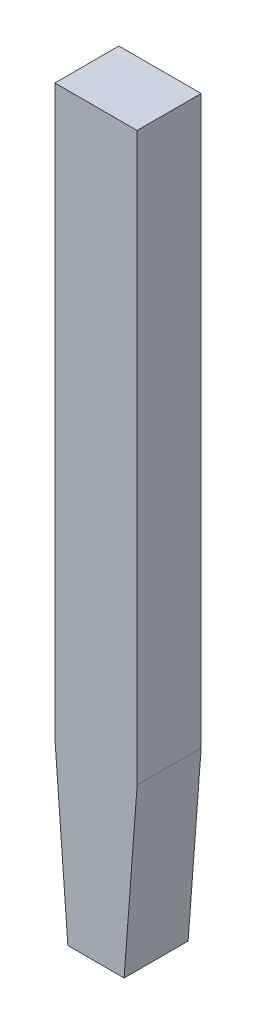
ISO-10303-21;
HEADER;
FILE_DESCRIPTION(('STEP AP214'),'2;1');
FILE_NAME('part.step','',(''),(''),'','','');
FILE_SCHEMA(('AUTOMOTIVE_DESIGN { 1 0 10303 214 1 1 1 1 }'));
ENDSEC;
DATA;
#1=APPLICATION_CONTEXT('core data for automotive mechanical design processes');
#2=APPLICATION_PROTOCOL_DEFINITION('international standard','automotive_design',2000,#1);
#3=PRODUCT_CONTEXT('',#1,'mechanical');
#4=PRODUCT('Part','Part','',(#3));
#5=PRODUCT_RELATED_PRODUCT_CATEGORY('part','',(#4));
#6=PRODUCT_DEFINITION_FORMATION('','',#4);
#7=PRODUCT_DEFINITION_CONTEXT('part definition',#1,'design');
#8=PRODUCT_DEFINITION('design','',#6,#7);
#9=PRODUCT_DEFINITION_SHAPE('','',#8);
#10=(LENGTH_UNIT() NAMED_UNIT(*) SI_UNIT(.MILLI.,.METRE.));
#11=(NAMED_UNIT(*) PLANE_ANGLE_UNIT() SI_UNIT($,.RADIAN.));
#12=(NAMED_UNIT(*) SI_UNIT($,.STERADIAN.) SOLID_ANGLE_UNIT());
#13=UNCERTAINTY_MEASURE_WITH_UNIT(LENGTH_MEASURE(1.E-05),#10,'distance_accuracy_value','');
#14=(GEOMETRIC_REPRESENTATION_CONTEXT(3) GLOBAL_UNCERTAINTY_ASSIGNED_CONTEXT((#13)) GLOBAL_UNIT_ASSIGNED_CONTEXT((#10,
#11,#12)) REPRESENTATION_CONTEXT('',''));
#15=CARTESIAN_POINT('',(0.,0.,0.));
#16=DIRECTION('',(0.,0.,1.));
#17=DIRECTION('',(1.,0.,0.));
#18=AXIS2_PLACEMENT_3D('',#15,#16,#17);
#19=CARTESIAN_POINT('',(50.41457889831,-0.5212621897839,0.8150000000459));
#20=DIRECTION('',(0.,0.,1.));
#21=DIRECTION('',(1.,0.,0.));
#22=AXIS2_PLACEMENT_3D('',#19,#20,#21);
#23=PLANE('',#22);
#24=DIRECTION('',(0.0747899482416361,0.997199309888456,0.));
#25=VECTOR('',#24,1.);
#26=CARTESIAN_POINT('',(51.01832889831,-15.17126218978,0.8150000000459));
#27=LINE('',#26,#25);
#28=CARTESIAN_POINT('',(51.01832889831,-15.17126218978,0.8150000000459));
#29=VERTEX_POINT('',#28);
#30=CARTESIAN_POINT('',(51.08957889831,-14.22126218978,0.8150000000459));
#31=VERTEX_POINT('',#30);
#32=EDGE_CURVE('E83',#29,#31,#27,.T.);
#33=ORIENTED_EDGE('',*,*,#32,.F.);
#34=DIRECTION('',(1.,0.,0.));
#35=VECTOR('',#34,1.);
#36=CARTESIAN_POINT('',(50.41457889831,-15.17126218978,0.8150000000459));
#37=LINE('',#36,#35);
#38=CARTESIAN_POINT('',(50.71082889831,-15.17126218978,0.8150000000459));
#39=VERTEX_POINT('',#38);
#40=EDGE_CURVE('E66',#39,#29,#37,.T.);
#41=ORIENTED_EDGE('',*,*,#40,.F.);
#42=DIRECTION('',(0.0747899482416361,-0.997199309888456,0.));
#43=VECTOR('',#42,1.);
#44=CARTESIAN_POINT('',(50.63957889831,-14.22126218978,0.8150000000459));
#45=LINE('',#44,#43);
#46=CARTESIAN_POINT('',(50.63957889831,-14.2212621897798,0.8150000000459));
#47=VERTEX_POINT('',#46);
#48=EDGE_CURVE('E20',#47,#39,#45,.T.);
#49=ORIENTED_EDGE('',*,*,#48,.F.);
#50=DIRECTION('',(0.,1.,0.));
#51=VECTOR('',#50,1.);
#52=CARTESIAN_POINT('',(50.63957889831,-7.321262189784,0.8150000000459));
#53=LINE('',#52,#51);
#54=CARTESIAN_POINT('',(50.63957889831,-11.12202888849,0.8150000000459));
#55=VERTEX_POINT('',#54);
#56=EDGE_CURVE('E96',#55,#47,#53,.F.);
#57=ORIENTED_EDGE('',*,*,#56,.F.);
#58=DIRECTION('',(1.,0.,0.));
#59=VECTOR('',#58,1.);
#60=CARTESIAN_POINT('',(44.47457889831,-11.12202888849,0.8150000000459));
#61=LINE('',#60,#59);
#62=CARTESIAN_POINT('',(51.08957889831,-11.12202888849,0.8150000000459));
#63=VERTEX_POINT('',#62);
#64=EDGE_CURVE('E89',#55,#63,#61,.T.);
#65=ORIENTED_EDGE('',*,*,#64,.T.);
#66=DIRECTION('',(0.,1.,0.));
#67=VECTOR('',#66,1.);
#68=CARTESIAN_POINT('',(51.08957889831,-7.321262189784,0.8150000000459));
#69=LINE('',#68,#67);
#70=EDGE_CURVE('E84',#31,#63,#69,.T.);
#71=ORIENTED_EDGE('',*,*,#70,.F.);
#72=EDGE_LOOP('',(#33,#41,#49,#57,#65,#71));
#73=FACE_BOUND('',#72,.T.);
#74=ADVANCED_FACE('F17',(#73),#23,.F.);
#75=CARTESIAN_POINT('',(51.08957889831,-7.321262189784,0.8150000000459));
#76=DIRECTION('',(1.,0.,0.));
#77=DIRECTION('',(0.,0.,-1.));
#78=AXIS2_PLACEMENT_3D('',#75,#76,#77);
#79=PLANE('',#78);
#80=DIRECTION('',(0.,1.,0.));
#81=VECTOR('',#80,1.);
#82=CARTESIAN_POINT('',(51.08957889831,-0.5212621897839,1.165000000046));
#83=LINE('',#82,#81);
#84=CARTESIAN_POINT('',(51.08957889831,-14.2212621897799,1.165000000046));
#85=VERTEX_POINT('',#84);
#86=CARTESIAN_POINT('',(51.08957889831,-11.12202888849,1.165000000046));
#87=VERTEX_POINT('',#86);
#88=EDGE_CURVE('E103',#85,#87,#83,.T.);
#89=ORIENTED_EDGE('',*,*,#88,.F.);
#90=DIRECTION('',(0.,0.,1.));
#91=VECTOR('',#90,1.);
#92=CARTESIAN_POINT('',(51.08957889831,-14.22126218978,0.8150000000459));
#93=LINE('',#92,#91);
#94=EDGE_CURVE('E100',#31,#85,#93,.T.);
#95=ORIENTED_EDGE('',*,*,#94,.F.);
#96=ORIENTED_EDGE('',*,*,#70,.T.);
#97=DIRECTION('',(0.,0.,-1.));
#98=VECTOR('',#97,1.);
#99=CARTESIAN_POINT('',(51.08957889831,-11.12202888849,-0.158278306686));
#100=LINE('',#99,#98);
#101=EDGE_CURVE('E91',#63,#87,#100,.F.);
#102=ORIENTED_EDGE('',*,*,#101,.T.);
#103=EDGE_LOOP('',(#89,#95,#96,#102));
#104=FACE_BOUND('',#103,.T.);
#105=ADVANCED_FACE('F124',(#104),#79,.T.);
#106=CARTESIAN_POINT('',(44.47457889831,-11.12202888849,-0.158278306686));
#107=DIRECTION('',(0.,-1.,0.));
#108=DIRECTION('',(0.,0.,-1.));
#109=AXIS2_PLACEMENT_3D('',#106,#107,#108);
#110=PLANE('',#109);
#111=ORIENTED_EDGE('',*,*,#64,.F.);
#112=DIRECTION('',(0.,0.,1.));
#113=VECTOR('',#112,1.);
#114=CARTESIAN_POINT('',(50.63957889831,-11.12202888849,0.8150000000459));
#115=LINE('',#114,#113);
#116=CARTESIAN_POINT('',(50.63957889831,-11.12202888849,1.165000000046));
#117=VERTEX_POINT('',#116);
#118=EDGE_CURVE('E93',#117,#55,#115,.F.);
#119=ORIENTED_EDGE('',*,*,#118,.F.);
#120=DIRECTION('',(1.,0.,0.));
#121=VECTOR('',#120,1.);
#122=CARTESIAN_POINT('',(50.41457889831,-11.12202888849,1.165000000046));
#123=LINE('',#122,#121);
#124=EDGE_CURVE('E106',#87,#117,#123,.F.);
#125=ORIENTED_EDGE('',*,*,#124,.F.);
#126=ORIENTED_EDGE('',*,*,#101,.F.);
#127=EDGE_LOOP('',(#111,#119,#125,#126));
#128=FACE_BOUND('',#127,.T.);
#129=ADVANCED_FACE('F125',(#128),#110,.F.);
#130=CARTESIAN_POINT('',(50.63957889831,-7.321262189784,0.8150000000459));
#131=DIRECTION('',(-1.,0.,0.));
#132=DIRECTION('',(0.,0.,1.));
#133=AXIS2_PLACEMENT_3D('',#130,#131,#132);
#134=PLANE('',#133);
#135=ORIENTED_EDGE('',*,*,#56,.T.);
#136=DIRECTION('',(0.,0.,1.));
#137=VECTOR('',#136,1.);
#138=CARTESIAN_POINT('',(50.63957889831,-14.22126218978,0.8150000000459));
#139=LINE('',#138,#137);
#140=CARTESIAN_POINT('',(50.63957889831,-14.2212621897799,1.165000000046));
#141=VERTEX_POINT('',#140);
#142=EDGE_CURVE('E73',#141,#47,#139,.F.);
#143=ORIENTED_EDGE('',*,*,#142,.F.);
#144=DIRECTION('',(0.,1.,0.));
#145=VECTOR('',#144,1.);
#146=CARTESIAN_POINT('',(50.63957889831,-0.5212621897839,1.165000000046));
#147=LINE('',#146,#145);
#148=EDGE_CURVE('E109',#117,#141,#147,.F.);
#149=ORIENTED_EDGE('',*,*,#148,.F.);
#150=ORIENTED_EDGE('',*,*,#118,.T.);
#151=EDGE_LOOP('',(#135,#143,#149,#150));
#152=FACE_BOUND('',#151,.T.);
#153=ADVANCED_FACE('F119',(#152),#134,.T.);
#154=CARTESIAN_POINT('',(50.63957889831,-14.22126218978,0.8150000000459));
#155=DIRECTION('',(-0.997199309888458,-0.0747899482416168,0.));
#156=DIRECTION('',(0.0747899482416168,-0.997199309888458,0.));
#157=AXIS2_PLACEMENT_3D('',#154,#155,#156);
#158=PLANE('',#157);
#159=DIRECTION('',(0.0747899482416361,-0.997199309888456,0.));
#160=VECTOR('',#159,1.);
#161=CARTESIAN_POINT('',(50.63957889831,-14.22126218978,1.165000000046));
#162=LINE('',#161,#160);
#163=CARTESIAN_POINT('',(50.71082889831,-15.17126218978,1.165000000046));
#164=VERTEX_POINT('',#163);
#165=EDGE_CURVE('E112',#141,#164,#162,.T.);
#166=ORIENTED_EDGE('',*,*,#165,.F.);
#167=ORIENTED_EDGE('',*,*,#142,.T.);
#168=ORIENTED_EDGE('',*,*,#48,.T.);
#169=DIRECTION('',(0.,0.,1.));
#170=VECTOR('',#169,1.);
#171=CARTESIAN_POINT('',(50.71082889831,-15.17126218978,-0.8137967800219));
#172=LINE('',#171,#170);
#173=EDGE_CURVE('E72',#39,#164,#172,.T.);
#174=ORIENTED_EDGE('',*,*,#173,.T.);
#175=EDGE_LOOP('',(#166,#167,#168,#174));
#176=FACE_BOUND('',#175,.T.);
#177=ADVANCED_FACE('F71',(#176),#158,.T.);
#178=CARTESIAN_POINT('',(38.93957889831,-15.17126218978,-0.8137967800219));
#179=DIRECTION('',(0.,1.,0.));
#180=DIRECTION('',(0.,0.,1.));
#181=AXIS2_PLACEMENT_3D('',#178,#179,#180);
#182=PLANE('',#181);
#183=ORIENTED_EDGE('',*,*,#40,.T.);
#184=DIRECTION('',(0.,0.,1.));
#185=VECTOR('',#184,1.);
#186=CARTESIAN_POINT('',(51.01832889831,-15.17126218978,0.8150000000459));
#187=LINE('',#186,#185);
#188=CARTESIAN_POINT('',(51.01832889831,-15.17126218978,1.165000000046));
#189=VERTEX_POINT('',#188);
#190=EDGE_CURVE('E35',#189,#29,#187,.F.);
#191=ORIENTED_EDGE('',*,*,#190,.F.);
#192=DIRECTION('',(1.,0.,0.));
#193=VECTOR('',#192,1.);
#194=CARTESIAN_POINT('',(50.41457889831,-15.17126218978,1.165000000046));
#195=LINE('',#194,#193);
#196=EDGE_CURVE('E26',#164,#189,#195,.T.);
#197=ORIENTED_EDGE('',*,*,#196,.F.);
#198=ORIENTED_EDGE('',*,*,#173,.F.);
#199=EDGE_LOOP('',(#183,#191,#197,#198));
#200=FACE_BOUND('',#199,.T.);
#201=ADVANCED_FACE('F77',(#200),#182,.F.);
#202=CARTESIAN_POINT('',(51.08957889831,-14.22126218978,0.8150000000459));
#203=DIRECTION('',(0.997199309888458,-0.0747899482416168,0.));
#204=DIRECTION('',(0.0747899482416168,0.997199309888458,0.));
#205=AXIS2_PLACEMENT_3D('',#202,#203,#204);
#206=PLANE('',#205);
#207=ORIENTED_EDGE('',*,*,#32,.T.);
#208=ORIENTED_EDGE('',*,*,#94,.T.);
#209=DIRECTION('',(0.0747899482416361,0.997199309888456,0.));
#210=VECTOR('',#209,1.);
#211=CARTESIAN_POINT('',(51.01832889831,-15.17126218978,1.165000000046));
#212=LINE('',#211,#210);
#213=EDGE_CURVE('E11',#189,#85,#212,.T.);
#214=ORIENTED_EDGE('',*,*,#213,.F.);
#215=ORIENTED_EDGE('',*,*,#190,.T.);
#216=EDGE_LOOP('',(#207,#208,#214,#215));
#217=FACE_BOUND('',#216,.T.);
#218=ADVANCED_FACE('F127',(#217),#206,.T.);
#219=CARTESIAN_POINT('',(50.41457889831,-0.5212621897839,1.165000000046));
#220=DIRECTION('',(0.,0.,1.));
#221=DIRECTION('',(1.,0.,0.));
#222=AXIS2_PLACEMENT_3D('',#219,#220,#221);
#223=PLANE('',#222);
#224=ORIENTED_EDGE('',*,*,#196,.T.);
#225=ORIENTED_EDGE('',*,*,#213,.T.);
#226=ORIENTED_EDGE('',*,*,#88,.T.);
#227=ORIENTED_EDGE('',*,*,#124,.T.);
#228=ORIENTED_EDGE('',*,*,#148,.T.);
#229=ORIENTED_EDGE('',*,*,#165,.T.);
#230=EDGE_LOOP('',(#224,#225,#226,#227,#228,#229));
#231=FACE_BOUND('',#230,.T.);
#232=ADVANCED_FACE('F115',(#231),#223,.T.);
#233=CLOSED_SHELL('',(#74,#105,#129,#153,#177,#201,#218,#232));
#234=MANIFOLD_SOLID_BREP('B1',#233);
#235=ADVANCED_BREP_SHAPE_REPRESENTATION('',(#18,#234),#14);
#236=SHAPE_DEFINITION_REPRESENTATION(#9,#235);
ENDSEC;
END-ISO-10303-21;
